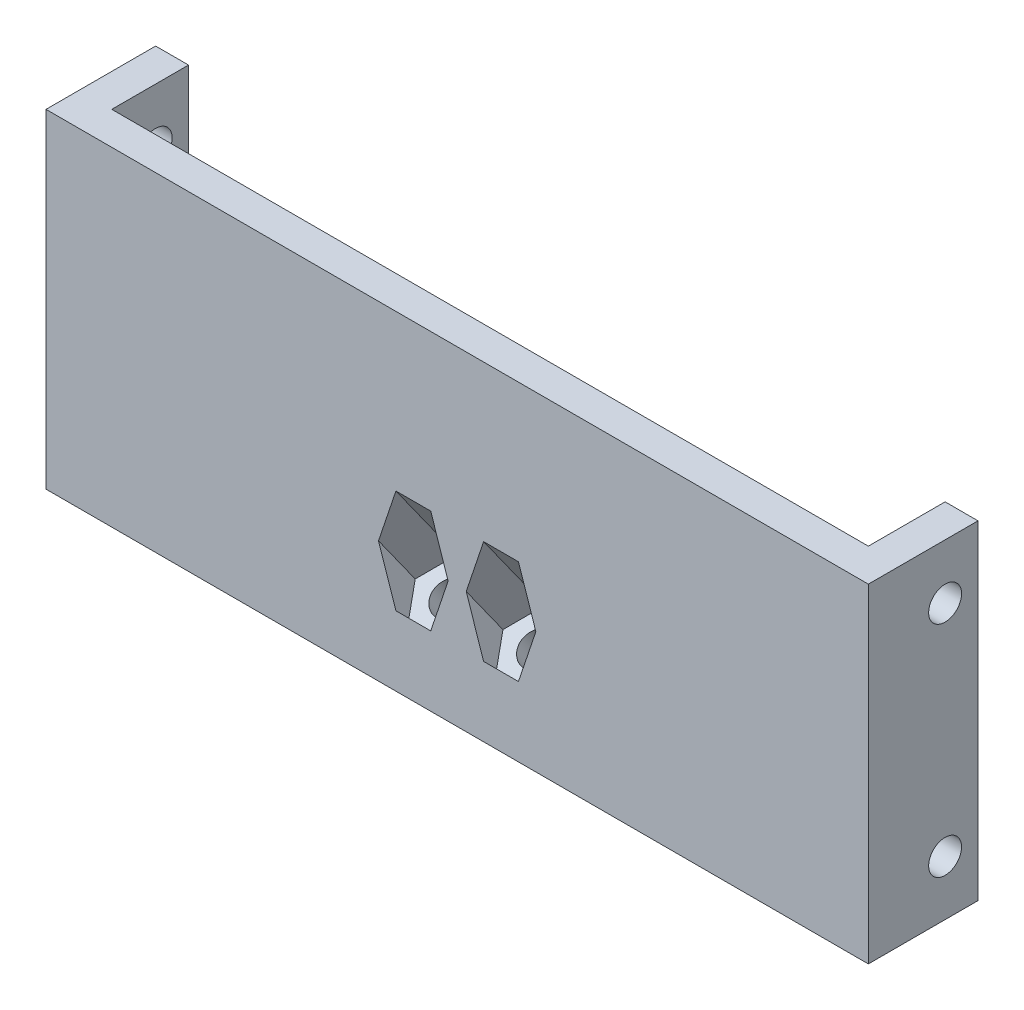
ISO-10303-21;
HEADER;
FILE_DESCRIPTION(('STEP AP214'),'2;1');
FILE_NAME('part.step','',(''),(''),'','','');
FILE_SCHEMA(('AUTOMOTIVE_DESIGN { 1 0 10303 214 1 1 1 1 }'));
ENDSEC;
DATA;
#1=APPLICATION_CONTEXT('core data for automotive mechanical design processes');
#2=APPLICATION_PROTOCOL_DEFINITION('international standard','automotive_design',2000,#1);
#3=PRODUCT_CONTEXT('',#1,'mechanical');
#4=PRODUCT('Part','Part','',(#3));
#5=PRODUCT_RELATED_PRODUCT_CATEGORY('part','',(#4));
#6=PRODUCT_DEFINITION_FORMATION('','',#4);
#7=PRODUCT_DEFINITION_CONTEXT('part definition',#1,'design');
#8=PRODUCT_DEFINITION('design','',#6,#7);
#9=PRODUCT_DEFINITION_SHAPE('','',#8);
#10=(LENGTH_UNIT() NAMED_UNIT(*) SI_UNIT(.MILLI.,.METRE.));
#11=(NAMED_UNIT(*) PLANE_ANGLE_UNIT() SI_UNIT($,.RADIAN.));
#12=(NAMED_UNIT(*) SI_UNIT($,.STERADIAN.) SOLID_ANGLE_UNIT());
#13=UNCERTAINTY_MEASURE_WITH_UNIT(LENGTH_MEASURE(1.E-05),#10,'distance_accuracy_value','');
#14=(GEOMETRIC_REPRESENTATION_CONTEXT(3) GLOBAL_UNCERTAINTY_ASSIGNED_CONTEXT((#13)) GLOBAL_UNIT_ASSIGNED_CONTEXT((#10,
#11,#12)) REPRESENTATION_CONTEXT('',''));
#15=CARTESIAN_POINT('',(0.,0.,0.));
#16=DIRECTION('',(0.,0.,1.));
#17=DIRECTION('',(1.,0.,0.));
#18=AXIS2_PLACEMENT_3D('',#15,#16,#17);
#19=CARTESIAN_POINT('',(37.5,-15.,3.));
#20=DIRECTION('',(-1.,0.,0.));
#21=DIRECTION('',(0.,0.,1.));
#22=AXIS2_PLACEMENT_3D('',#19,#20,#21);
#23=PLANE('',#22);
#24=CARTESIAN_POINT('',(37.5,-10.,-4.));
#25=DIRECTION('',(1.,0.,0.));
#26=DIRECTION('',(0.,0.,1.));
#27=AXIS2_PLACEMENT_3D('',#24,#25,#26);
#28=CIRCLE('',#27,1.5);
#29=CARTESIAN_POINT('',(37.5,-10.,-2.5));
#30=VERTEX_POINT('',#29);
#31=EDGE_CURVE('E323',#30,#30,#28,.T.);
#32=ORIENTED_EDGE('',*,*,#31,.F.);
#33=EDGE_LOOP('',(#32));
#34=FACE_BOUND('',#33,.T.);
#35=CARTESIAN_POINT('',(37.5,10.,-4.));
#36=DIRECTION('',(-1.,0.,0.));
#37=DIRECTION('',(0.,0.,1.));
#38=AXIS2_PLACEMENT_3D('',#35,#36,#37);
#39=CIRCLE('',#38,1.5);
#40=CARTESIAN_POINT('',(37.5,10.,-2.5));
#41=VERTEX_POINT('',#40);
#42=EDGE_CURVE('E329',#41,#41,#39,.T.);
#43=ORIENTED_EDGE('',*,*,#42,.T.);
#44=EDGE_LOOP('',(#43));
#45=FACE_BOUND('',#44,.T.);
#46=DIRECTION('',(0.,0.,-1.));
#47=VECTOR('',#46,1.);
#48=CARTESIAN_POINT('',(37.5,-15.,3.));
#49=LINE('',#48,#47);
#50=CARTESIAN_POINT('',(37.5,-15.,3.));
#51=VERTEX_POINT('',#50);
#52=CARTESIAN_POINT('',(37.5,-15.,-7.));
#53=VERTEX_POINT('',#52);
#54=EDGE_CURVE('E364',#51,#53,#49,.T.);
#55=ORIENTED_EDGE('',*,*,#54,.T.);
#56=DIRECTION('',(0.,-1.,0.));
#57=VECTOR('',#56,1.);
#58=CARTESIAN_POINT('',(37.5,-15.,-7.));
#59=LINE('',#58,#57);
#60=CARTESIAN_POINT('',(37.5,15.,-7.));
#61=VERTEX_POINT('',#60);
#62=EDGE_CURVE('E335',#61,#53,#59,.T.);
#63=ORIENTED_EDGE('',*,*,#62,.F.);
#64=DIRECTION('',(0.,0.,-1.));
#65=VECTOR('',#64,1.);
#66=CARTESIAN_POINT('',(37.5,15.,3.));
#67=LINE('',#66,#65);
#68=CARTESIAN_POINT('',(37.5,15.,3.));
#69=VERTEX_POINT('',#68);
#70=EDGE_CURVE('E375',#69,#61,#67,.T.);
#71=ORIENTED_EDGE('',*,*,#70,.F.);
#72=DIRECTION('',(0.,1.,0.));
#73=VECTOR('',#72,1.);
#74=CARTESIAN_POINT('',(37.5,-15.,3.));
#75=LINE('',#74,#73);
#76=EDGE_CURVE('E354',#51,#69,#75,.T.);
#77=ORIENTED_EDGE('',*,*,#76,.F.);
#78=EDGE_LOOP('',(#55,#63,#71,#77));
#79=FACE_BOUND('',#78,.T.);
#80=ADVANCED_FACE('F35',(#34,#45,#79),#23,.F.);
#81=CARTESIAN_POINT('',(-37.5,15.,3.));
#82=DIRECTION('',(0.,-1.,0.));
#83=DIRECTION('',(0.,0.,-1.));
#84=AXIS2_PLACEMENT_3D('',#81,#82,#83);
#85=PLANE('',#84);
#86=ORIENTED_EDGE('',*,*,#70,.T.);
#87=DIRECTION('',(1.,0.,0.));
#88=VECTOR('',#87,1.);
#89=CARTESIAN_POINT('',(34.5,15.,-7.));
#90=LINE('',#89,#88);
#91=CARTESIAN_POINT('',(34.5,15.,-7.));
#92=VERTEX_POINT('',#91);
#93=EDGE_CURVE('E342',#92,#61,#90,.T.);
#94=ORIENTED_EDGE('',*,*,#93,.F.);
#95=DIRECTION('',(0.,0.,1.));
#96=VECTOR('',#95,1.);
#97=CARTESIAN_POINT('',(34.5,15.,-7.));
#98=LINE('',#97,#96);
#99=CARTESIAN_POINT('',(34.5,15.,0.));
#100=VERTEX_POINT('',#99);
#101=EDGE_CURVE('E345',#92,#100,#98,.T.);
#102=ORIENTED_EDGE('',*,*,#101,.T.);
#103=DIRECTION('',(-1.,0.,0.));
#104=VECTOR('',#103,1.);
#105=CARTESIAN_POINT('',(-37.5,15.,0.));
#106=LINE('',#105,#104);
#107=CARTESIAN_POINT('',(-34.5,15.,0.));
#108=VERTEX_POINT('',#107);
#109=EDGE_CURVE('E353',#100,#108,#106,.T.);
#110=ORIENTED_EDGE('',*,*,#109,.T.);
#111=DIRECTION('',(0.,0.,1.));
#112=VECTOR('',#111,1.);
#113=CARTESIAN_POINT('',(-34.5,15.,-7.));
#114=LINE('',#113,#112);
#115=CARTESIAN_POINT('',(-34.5,15.,-7.));
#116=VERTEX_POINT('',#115);
#117=EDGE_CURVE('E320',#116,#108,#114,.T.);
#118=ORIENTED_EDGE('',*,*,#117,.F.);
#119=DIRECTION('',(-1.,0.,0.));
#120=VECTOR('',#119,1.);
#121=CARTESIAN_POINT('',(-34.5,15.,-7.));
#122=LINE('',#121,#120);
#123=CARTESIAN_POINT('',(-37.5,15.,-7.));
#124=VERTEX_POINT('',#123);
#125=EDGE_CURVE('E306',#116,#124,#122,.T.);
#126=ORIENTED_EDGE('',*,*,#125,.T.);
#127=DIRECTION('',(0.,0.,-1.));
#128=VECTOR('',#127,1.);
#129=CARTESIAN_POINT('',(-37.5,15.,3.));
#130=LINE('',#129,#128);
#131=CARTESIAN_POINT('',(-37.5,15.,3.));
#132=VERTEX_POINT('',#131);
#133=EDGE_CURVE('E373',#132,#124,#130,.T.);
#134=ORIENTED_EDGE('',*,*,#133,.F.);
#135=DIRECTION('',(-1.,0.,0.));
#136=VECTOR('',#135,1.);
#137=CARTESIAN_POINT('',(-37.5,15.,3.));
#138=LINE('',#137,#136);
#139=EDGE_CURVE('E357',#69,#132,#138,.T.);
#140=ORIENTED_EDGE('',*,*,#139,.F.);
#141=EDGE_LOOP('',(#86,#94,#102,#110,#118,#126,#134,#140));
#142=FACE_BOUND('',#141,.T.);
#143=ADVANCED_FACE('F462',(#142),#85,.F.);
#144=CARTESIAN_POINT('',(-37.5,-15.,3.));
#145=DIRECTION('',(1.,0.,0.));
#146=DIRECTION('',(0.,0.,-1.));
#147=AXIS2_PLACEMENT_3D('',#144,#145,#146);
#148=PLANE('',#147);
#149=CARTESIAN_POINT('',(-37.5,-10.,-4.));
#150=DIRECTION('',(1.,0.,0.));
#151=DIRECTION('',(0.,0.,1.));
#152=AXIS2_PLACEMENT_3D('',#149,#150,#151);
#153=CIRCLE('',#152,1.5);
#154=CARTESIAN_POINT('',(-37.5,-10.,-2.5));
#155=VERTEX_POINT('',#154);
#156=EDGE_CURVE('E291',#155,#155,#153,.T.);
#157=ORIENTED_EDGE('',*,*,#156,.T.);
#158=EDGE_LOOP('',(#157));
#159=FACE_BOUND('',#158,.T.);
#160=CARTESIAN_POINT('',(-37.5,10.,-4.));
#161=DIRECTION('',(-1.,0.,0.));
#162=DIRECTION('',(0.,0.,1.));
#163=AXIS2_PLACEMENT_3D('',#160,#161,#162);
#164=CIRCLE('',#163,1.5);
#165=CARTESIAN_POINT('',(-37.5,10.,-2.5));
#166=VERTEX_POINT('',#165);
#167=EDGE_CURVE('E297',#166,#166,#164,.T.);
#168=ORIENTED_EDGE('',*,*,#167,.F.);
#169=EDGE_LOOP('',(#168));
#170=FACE_BOUND('',#169,.T.);
#171=ORIENTED_EDGE('',*,*,#133,.T.);
#172=DIRECTION('',(0.,-1.,0.));
#173=VECTOR('',#172,1.);
#174=CARTESIAN_POINT('',(-37.5,-15.,-7.));
#175=LINE('',#174,#173);
#176=CARTESIAN_POINT('',(-37.5,-15.,-7.));
#177=VERTEX_POINT('',#176);
#178=EDGE_CURVE('E303',#124,#177,#175,.T.);
#179=ORIENTED_EDGE('',*,*,#178,.T.);
#180=DIRECTION('',(0.,0.,-1.));
#181=VECTOR('',#180,1.);
#182=CARTESIAN_POINT('',(-37.5,-15.,3.));
#183=LINE('',#182,#181);
#184=CARTESIAN_POINT('',(-37.5,-15.,3.));
#185=VERTEX_POINT('',#184);
#186=EDGE_CURVE('E371',#185,#177,#183,.T.);
#187=ORIENTED_EDGE('',*,*,#186,.F.);
#188=DIRECTION('',(0.,-1.,0.));
#189=VECTOR('',#188,1.);
#190=CARTESIAN_POINT('',(-37.5,-15.,3.));
#191=LINE('',#190,#189);
#192=EDGE_CURVE('E360',#132,#185,#191,.T.);
#193=ORIENTED_EDGE('',*,*,#192,.F.);
#194=EDGE_LOOP('',(#171,#179,#187,#193));
#195=FACE_BOUND('',#194,.T.);
#196=ADVANCED_FACE('F468',(#159,#170,#195),#148,.F.);
#197=CARTESIAN_POINT('',(-37.5,-15.,3.));
#198=DIRECTION('',(0.,1.,0.));
#199=DIRECTION('',(0.,0.,1.));
#200=AXIS2_PLACEMENT_3D('',#197,#198,#199);
#201=PLANE('',#200);
#202=DIRECTION('',(1.,0.,0.));
#203=VECTOR('',#202,1.);
#204=CARTESIAN_POINT('',(-37.5,-15.,0.));
#205=LINE('',#204,#203);
#206=CARTESIAN_POINT('',(-34.5,-15.,0.));
#207=VERTEX_POINT('',#206);
#208=CARTESIAN_POINT('',(-8.,-15.,0.));
#209=VERTEX_POINT('',#208);
#210=EDGE_CURVE('E358',#207,#209,#205,.T.);
#211=ORIENTED_EDGE('',*,*,#210,.T.);
#212=DIRECTION('',(1.,0.,0.));
#213=VECTOR('',#212,1.);
#214=CARTESIAN_POINT('',(8.,-15.,0.));
#215=LINE('',#214,#213);
#216=CARTESIAN_POINT('',(8.,-15.,0.));
#217=VERTEX_POINT('',#216);
#218=EDGE_CURVE('E377',#209,#217,#215,.T.);
#219=ORIENTED_EDGE('',*,*,#218,.T.);
#220=CARTESIAN_POINT('',(34.5,-15.,0.));
#221=VERTEX_POINT('',#220);
#222=EDGE_CURVE('E367',#217,#221,#205,.T.);
#223=ORIENTED_EDGE('',*,*,#222,.T.);
#224=DIRECTION('',(0.,0.,1.));
#225=VECTOR('',#224,1.);
#226=CARTESIAN_POINT('',(34.5,-15.,-7.));
#227=LINE('',#226,#225);
#228=CARTESIAN_POINT('',(34.5,-15.,-7.));
#229=VERTEX_POINT('',#228);
#230=EDGE_CURVE('E350',#229,#221,#227,.T.);
#231=ORIENTED_EDGE('',*,*,#230,.F.);
#232=DIRECTION('',(-1.,0.,0.));
#233=VECTOR('',#232,1.);
#234=CARTESIAN_POINT('',(34.5,-15.,-7.));
#235=LINE('',#234,#233);
#236=EDGE_CURVE('E338',#53,#229,#235,.T.);
#237=ORIENTED_EDGE('',*,*,#236,.F.);
#238=ORIENTED_EDGE('',*,*,#54,.F.);
#239=DIRECTION('',(1.,0.,0.));
#240=VECTOR('',#239,1.);
#241=CARTESIAN_POINT('',(-37.5,-15.,3.));
#242=LINE('',#241,#240);
#243=EDGE_CURVE('E362',#185,#51,#242,.T.);
#244=ORIENTED_EDGE('',*,*,#243,.F.);
#245=ORIENTED_EDGE('',*,*,#186,.T.);
#246=DIRECTION('',(1.,0.,0.));
#247=VECTOR('',#246,1.);
#248=CARTESIAN_POINT('',(-34.5,-15.,-7.));
#249=LINE('',#248,#247);
#250=CARTESIAN_POINT('',(-34.5,-15.,-7.));
#251=VERTEX_POINT('',#250);
#252=EDGE_CURVE('E312',#177,#251,#249,.T.);
#253=ORIENTED_EDGE('',*,*,#252,.T.);
#254=DIRECTION('',(0.,0.,1.));
#255=VECTOR('',#254,1.);
#256=CARTESIAN_POINT('',(-34.5,-15.,-7.));
#257=LINE('',#256,#255);
#258=EDGE_CURVE('E315',#251,#207,#257,.T.);
#259=ORIENTED_EDGE('',*,*,#258,.T.);
#260=EDGE_LOOP('',(#211,#219,#223,#231,#237,#238,#244,#245,#253,#259));
#261=FACE_BOUND('',#260,.T.);
#262=ADVANCED_FACE('F513',(#261),#201,.F.);
#263=CARTESIAN_POINT('',(0.,0.,3.));
#264=DIRECTION('',(0.,0.,-1.));
#265=DIRECTION('',(-1.,0.,0.));
#266=AXIS2_PLACEMENT_3D('',#263,#264,#265);
#267=PLANE('',#266);
#268=DIRECTION('',(1.,0.,0.));
#269=VECTOR('',#268,1.);
#270=CARTESIAN_POINT('',(0.,0.813139110507579,3.));
#271=LINE('',#270,#269);
#272=CARTESIAN_POINT('',(-5.58771324027147,0.813139110507578,3.));
#273=VERTEX_POINT('',#272);
#274=CARTESIAN_POINT('',(-2.41228675972853,0.813139110507578,3.));
#275=VERTEX_POINT('',#274);
#276=EDGE_CURVE('E44',#273,#275,#271,.T.);
#277=ORIENTED_EDGE('',*,*,#276,.T.);
#278=DIRECTION('',(0.318142381487888,-0.948042944755782,0.));
#279=VECTOR('',#278,1.);
#280=CARTESIAN_POINT('',(-1.92287514684069,-0.645274649111341,3.));
#281=LINE('',#280,#279);
#282=CARTESIAN_POINT('',(-0.824573519457062,-3.91813978636587,3.));
#283=VERTEX_POINT('',#282);
#284=EDGE_CURVE('E11',#275,#283,#281,.T.);
#285=ORIENTED_EDGE('',*,*,#284,.T.);
#286=DIRECTION('',(-0.318142381487888,-0.948042944755782,0.));
#287=VECTOR('',#286,1.);
#288=CARTESIAN_POINT('',(0.440645824415849,-0.147871056630736,3.));
#289=LINE('',#288,#287);
#290=CARTESIAN_POINT('',(-2.41228675972853,-8.64941868323933,3.));
#291=VERTEX_POINT('',#290);
#292=EDGE_CURVE('E206',#283,#291,#289,.T.);
#293=ORIENTED_EDGE('',*,*,#292,.T.);
#294=DIRECTION('',(-1.,0.,0.));
#295=VECTOR('',#294,1.);
#296=CARTESIAN_POINT('',(0.,-8.64941868323933,3.));
#297=LINE('',#296,#295);
#298=CARTESIAN_POINT('',(-5.58771324027147,-8.64941868323934,3.));
#299=VERTEX_POINT('',#298);
#300=EDGE_CURVE('E429',#291,#299,#297,.T.);
#301=ORIENTED_EDGE('',*,*,#300,.T.);
#302=DIRECTION('',(-0.318142381487888,0.948042944755782,0.));
#303=VECTOR('',#302,1.);
#304=CARTESIAN_POINT('',(-7.63092922522558,-2.5607721782099,3.));
#305=LINE('',#304,#303);
#306=CARTESIAN_POINT('',(-7.17542648054294,-3.91813978636588,3.));
#307=VERTEX_POINT('',#306);
#308=EDGE_CURVE('E432',#299,#307,#305,.T.);
#309=ORIENTED_EDGE('',*,*,#308,.T.);
#310=DIRECTION('',(0.318142381487888,0.948042944755782,0.));
#311=VECTOR('',#310,1.);
#312=CARTESIAN_POINT('',(-5.26740825396904,1.76762647246782,3.));
#313=LINE('',#312,#311);
#314=EDGE_CURVE('E435',#307,#273,#313,.T.);
#315=ORIENTED_EDGE('',*,*,#314,.T.);
#316=EDGE_LOOP('',(#277,#285,#293,#301,#309,#315));
#317=FACE_BOUND('',#316,.T.);
#318=DIRECTION('',(1.,0.,0.));
#319=VECTOR('',#318,1.);
#320=CARTESIAN_POINT('',(0.,0.813139110507579,3.));
#321=LINE('',#320,#319);
#322=CARTESIAN_POINT('',(2.41228675972853,0.813139110507585,3.));
#323=VERTEX_POINT('',#322);
#324=CARTESIAN_POINT('',(5.58771324027147,0.813139110507578,3.));
#325=VERTEX_POINT('',#324);
#326=EDGE_CURVE('E422',#323,#325,#321,.T.);
#327=ORIENTED_EDGE('',*,*,#326,.T.);
#328=DIRECTION('',(0.318142381487888,-0.948042944755782,0.));
#329=VECTOR('',#328,1.);
#330=CARTESIAN_POINT('',(5.26740825396904,1.76762647246782,3.));
#331=LINE('',#330,#329);
#332=CARTESIAN_POINT('',(7.17542648054294,-3.91813978636588,3.));
#333=VERTEX_POINT('',#332);
#334=EDGE_CURVE('E425',#325,#333,#331,.T.);
#335=ORIENTED_EDGE('',*,*,#334,.T.);
#336=DIRECTION('',(-0.318142381487889,-0.948042944755782,0.));
#337=VECTOR('',#336,1.);
#338=CARTESIAN_POINT('',(7.63092922522557,-2.5607721782099,3.));
#339=LINE('',#338,#337);
#340=CARTESIAN_POINT('',(5.58771324027147,-8.64941868323934,3.));
#341=VERTEX_POINT('',#340);
#342=EDGE_CURVE('E406',#333,#341,#339,.T.);
#343=ORIENTED_EDGE('',*,*,#342,.T.);
#344=DIRECTION('',(-1.,0.,0.));
#345=VECTOR('',#344,1.);
#346=CARTESIAN_POINT('',(0.,-8.64941868323933,3.));
#347=LINE('',#346,#345);
#348=CARTESIAN_POINT('',(2.41228675972853,-8.64941868323934,3.));
#349=VERTEX_POINT('',#348);
#350=EDGE_CURVE('E413',#341,#349,#347,.T.);
#351=ORIENTED_EDGE('',*,*,#350,.T.);
#352=DIRECTION('',(-0.318142381487888,0.948042944755782,0.));
#353=VECTOR('',#352,1.);
#354=CARTESIAN_POINT('',(-0.440645824415854,-0.147871056630738,3.));
#355=LINE('',#354,#353);
#356=CARTESIAN_POINT('',(0.824573519457056,-3.91813978636587,3.));
#357=VERTEX_POINT('',#356);
#358=EDGE_CURVE('E416',#349,#357,#355,.T.);
#359=ORIENTED_EDGE('',*,*,#358,.T.);
#360=DIRECTION('',(0.318142381487888,0.948042944755782,0.));
#361=VECTOR('',#360,1.);
#362=CARTESIAN_POINT('',(1.92287514684068,-0.645274649111339,3.));
#363=LINE('',#362,#361);
#364=EDGE_CURVE('E419',#357,#323,#363,.T.);
#365=ORIENTED_EDGE('',*,*,#364,.T.);
#366=EDGE_LOOP('',(#327,#335,#343,#351,#359,#365));
#367=FACE_BOUND('',#366,.T.);
#368=ORIENTED_EDGE('',*,*,#76,.T.);
#369=ORIENTED_EDGE('',*,*,#139,.T.);
#370=ORIENTED_EDGE('',*,*,#192,.T.);
#371=ORIENTED_EDGE('',*,*,#243,.T.);
#372=EDGE_LOOP('',(#368,#369,#370,#371));
#373=FACE_BOUND('',#372,.T.);
#374=ADVANCED_FACE('F439',(#317,#367,#373),#267,.F.);
#375=CARTESIAN_POINT('',(0.,0.,0.));
#376=DIRECTION('',(0.,0.,-1.));
#377=DIRECTION('',(-1.,0.,0.));
#378=AXIS2_PLACEMENT_3D('',#375,#376,#377);
#379=PLANE('',#378);
#380=DIRECTION('',(-1.,0.,0.));
#381=VECTOR('',#380,1.);
#382=CARTESIAN_POINT('',(0.,-1.99999999999996,0.));
#383=LINE('',#382,#381);
#384=CARTESIAN_POINT('',(8.,-1.99999999999996,0.));
#385=VERTEX_POINT('',#384);
#386=CARTESIAN_POINT('',(-8.,-1.99999999999996,0.));
#387=VERTEX_POINT('',#386);
#388=EDGE_CURVE('E388',#385,#387,#383,.T.);
#389=ORIENTED_EDGE('',*,*,#388,.T.);
#390=DIRECTION('',(0.,-1.,0.));
#391=VECTOR('',#390,1.);
#392=CARTESIAN_POINT('',(-8.,-7.,0.));
#393=LINE('',#392,#391);
#394=EDGE_CURVE('E281',#387,#209,#393,.T.);
#395=ORIENTED_EDGE('',*,*,#394,.T.);
#396=ORIENTED_EDGE('',*,*,#210,.F.);
#397=DIRECTION('',(0.,1.,0.));
#398=VECTOR('',#397,1.);
#399=CARTESIAN_POINT('',(-34.5,-15.,0.));
#400=LINE('',#399,#398);
#401=EDGE_CURVE('E300',#207,#108,#400,.T.);
#402=ORIENTED_EDGE('',*,*,#401,.T.);
#403=ORIENTED_EDGE('',*,*,#109,.F.);
#404=DIRECTION('',(0.,1.,0.));
#405=VECTOR('',#404,1.);
#406=CARTESIAN_POINT('',(34.5,-15.,0.));
#407=LINE('',#406,#405);
#408=EDGE_CURVE('E332',#221,#100,#407,.T.);
#409=ORIENTED_EDGE('',*,*,#408,.F.);
#410=ORIENTED_EDGE('',*,*,#222,.F.);
#411=DIRECTION('',(0.,-1.,0.));
#412=VECTOR('',#411,1.);
#413=CARTESIAN_POINT('',(8.,-7.,0.));
#414=LINE('',#413,#412);
#415=EDGE_CURVE('E285',#385,#217,#414,.T.);
#416=ORIENTED_EDGE('',*,*,#415,.F.);
#417=EDGE_LOOP('',(#389,#395,#396,#402,#403,#409,#410,#416));
#418=FACE_BOUND('',#417,.T.);
#419=ADVANCED_FACE('F511',(#418),#379,.T.);
#420=CARTESIAN_POINT('',(34.5,-15.,-7.));
#421=DIRECTION('',(1.,0.,0.));
#422=DIRECTION('',(0.,0.,-1.));
#423=AXIS2_PLACEMENT_3D('',#420,#421,#422);
#424=PLANE('',#423);
#425=CARTESIAN_POINT('',(34.5,-10.,-4.));
#426=DIRECTION('',(1.,0.,0.));
#427=DIRECTION('',(0.,0.,1.));
#428=AXIS2_PLACEMENT_3D('',#425,#426,#427);
#429=CIRCLE('',#428,1.5);
#430=CARTESIAN_POINT('',(34.5,-10.,-2.5));
#431=VERTEX_POINT('',#430);
#432=EDGE_CURVE('E322',#431,#431,#429,.T.);
#433=ORIENTED_EDGE('',*,*,#432,.T.);
#434=EDGE_LOOP('',(#433));
#435=FACE_BOUND('',#434,.T.);
#436=CARTESIAN_POINT('',(34.5,10.,-4.));
#437=DIRECTION('',(-1.,0.,0.));
#438=DIRECTION('',(0.,0.,1.));
#439=AXIS2_PLACEMENT_3D('',#436,#437,#438);
#440=CIRCLE('',#439,1.5);
#441=CARTESIAN_POINT('',(34.5,10.,-2.5));
#442=VERTEX_POINT('',#441);
#443=EDGE_CURVE('E326',#442,#442,#440,.T.);
#444=ORIENTED_EDGE('',*,*,#443,.F.);
#445=EDGE_LOOP('',(#444));
#446=FACE_BOUND('',#445,.T.);
#447=ORIENTED_EDGE('',*,*,#408,.T.);
#448=ORIENTED_EDGE('',*,*,#101,.F.);
#449=DIRECTION('',(0.,1.,0.));
#450=VECTOR('',#449,1.);
#451=CARTESIAN_POINT('',(34.5,-15.,-7.));
#452=LINE('',#451,#450);
#453=EDGE_CURVE('E340',#229,#92,#452,.T.);
#454=ORIENTED_EDGE('',*,*,#453,.F.);
#455=ORIENTED_EDGE('',*,*,#230,.T.);
#456=EDGE_LOOP('',(#447,#448,#454,#455));
#457=FACE_BOUND('',#456,.T.);
#458=ADVANCED_FACE('F528',(#435,#446,#457),#424,.F.);
#459=CARTESIAN_POINT('',(0.,0.,-7.));
#460=DIRECTION('',(0.,0.,-1.));
#461=DIRECTION('',(-1.,0.,0.));
#462=AXIS2_PLACEMENT_3D('',#459,#460,#461);
#463=PLANE('',#462);
#464=ORIENTED_EDGE('',*,*,#62,.T.);
#465=ORIENTED_EDGE('',*,*,#236,.T.);
#466=ORIENTED_EDGE('',*,*,#453,.T.);
#467=ORIENTED_EDGE('',*,*,#93,.T.);
#468=EDGE_LOOP('',(#464,#465,#466,#467));
#469=FACE_BOUND('',#468,.T.);
#470=ADVANCED_FACE('F535',(#469),#463,.T.);
#471=CARTESIAN_POINT('',(37.5,10.,-4.));
#472=DIRECTION('',(-1.,0.,0.));
#473=DIRECTION('',(0.,0.,1.));
#474=AXIS2_PLACEMENT_3D('',#471,#472,#473);
#475=CYLINDRICAL_SURFACE('',#474,1.5);
#476=ORIENTED_EDGE('',*,*,#42,.F.);
#477=EDGE_LOOP('',(#476));
#478=FACE_BOUND('',#477,.T.);
#479=ORIENTED_EDGE('',*,*,#443,.T.);
#480=EDGE_LOOP('',(#479));
#481=FACE_BOUND('',#480,.T.);
#482=ADVANCED_FACE('F569',(#478,#481),#475,.F.);
#483=CARTESIAN_POINT('',(37.5,-10.,-4.));
#484=DIRECTION('',(-1.,0.,0.));
#485=DIRECTION('',(0.,0.,1.));
#486=AXIS2_PLACEMENT_3D('',#483,#484,#485);
#487=CYLINDRICAL_SURFACE('',#486,1.5);
#488=ORIENTED_EDGE('',*,*,#31,.T.);
#489=EDGE_LOOP('',(#488));
#490=FACE_BOUND('',#489,.T.);
#491=ORIENTED_EDGE('',*,*,#432,.F.);
#492=EDGE_LOOP('',(#491));
#493=FACE_BOUND('',#492,.T.);
#494=ADVANCED_FACE('F565',(#490,#493),#487,.F.);
#495=CARTESIAN_POINT('',(-34.5,-15.,-7.));
#496=DIRECTION('',(1.,0.,0.));
#497=DIRECTION('',(0.,0.,-1.));
#498=AXIS2_PLACEMENT_3D('',#495,#496,#497);
#499=PLANE('',#498);
#500=CARTESIAN_POINT('',(-34.5,-10.,-4.));
#501=DIRECTION('',(1.,0.,0.));
#502=DIRECTION('',(0.,0.,1.));
#503=AXIS2_PLACEMENT_3D('',#500,#501,#502);
#504=CIRCLE('',#503,1.5);
#505=CARTESIAN_POINT('',(-34.5,-10.,-2.5));
#506=VERTEX_POINT('',#505);
#507=EDGE_CURVE('E284',#506,#506,#504,.T.);
#508=ORIENTED_EDGE('',*,*,#507,.F.);
#509=EDGE_LOOP('',(#508));
#510=FACE_BOUND('',#509,.T.);
#511=CARTESIAN_POINT('',(-34.5,10.,-4.));
#512=DIRECTION('',(-1.,0.,0.));
#513=DIRECTION('',(0.,0.,1.));
#514=AXIS2_PLACEMENT_3D('',#511,#512,#513);
#515=CIRCLE('',#514,1.5);
#516=CARTESIAN_POINT('',(-34.5,10.,-2.5));
#517=VERTEX_POINT('',#516);
#518=EDGE_CURVE('E294',#517,#517,#515,.T.);
#519=ORIENTED_EDGE('',*,*,#518,.T.);
#520=EDGE_LOOP('',(#519));
#521=FACE_BOUND('',#520,.T.);
#522=ORIENTED_EDGE('',*,*,#401,.F.);
#523=ORIENTED_EDGE('',*,*,#258,.F.);
#524=DIRECTION('',(0.,1.,0.));
#525=VECTOR('',#524,1.);
#526=CARTESIAN_POINT('',(-34.5,-15.,-7.));
#527=LINE('',#526,#525);
#528=EDGE_CURVE('E309',#251,#116,#527,.T.);
#529=ORIENTED_EDGE('',*,*,#528,.T.);
#530=ORIENTED_EDGE('',*,*,#117,.T.);
#531=EDGE_LOOP('',(#522,#523,#529,#530));
#532=FACE_BOUND('',#531,.T.);
#533=ADVANCED_FACE('F517',(#510,#521,#532),#499,.T.);
#534=CARTESIAN_POINT('',(0.,0.,-7.));
#535=DIRECTION('',(0.,0.,-1.));
#536=DIRECTION('',(1.,0.,0.));
#537=AXIS2_PLACEMENT_3D('',#534,#535,#536);
#538=PLANE('',#537);
#539=ORIENTED_EDGE('',*,*,#178,.F.);
#540=ORIENTED_EDGE('',*,*,#125,.F.);
#541=ORIENTED_EDGE('',*,*,#528,.F.);
#542=ORIENTED_EDGE('',*,*,#252,.F.);
#543=EDGE_LOOP('',(#539,#540,#541,#542));
#544=FACE_BOUND('',#543,.T.);
#545=ADVANCED_FACE('F521',(#544),#538,.T.);
#546=CARTESIAN_POINT('',(-37.5,10.,-4.));
#547=DIRECTION('',(1.,0.,0.));
#548=DIRECTION('',(0.,0.,-1.));
#549=AXIS2_PLACEMENT_3D('',#546,#547,#548);
#550=CYLINDRICAL_SURFACE('',#549,1.5);
#551=ORIENTED_EDGE('',*,*,#167,.T.);
#552=EDGE_LOOP('',(#551));
#553=FACE_BOUND('',#552,.T.);
#554=ORIENTED_EDGE('',*,*,#518,.F.);
#555=EDGE_LOOP('',(#554));
#556=FACE_BOUND('',#555,.T.);
#557=ADVANCED_FACE('F556',(#553,#556),#550,.F.);
#558=CARTESIAN_POINT('',(-37.5,-10.,-4.));
#559=DIRECTION('',(1.,0.,0.));
#560=DIRECTION('',(0.,0.,-1.));
#561=AXIS2_PLACEMENT_3D('',#558,#559,#560);
#562=CYLINDRICAL_SURFACE('',#561,1.5);
#563=ORIENTED_EDGE('',*,*,#156,.F.);
#564=EDGE_LOOP('',(#563));
#565=FACE_BOUND('',#564,.T.);
#566=ORIENTED_EDGE('',*,*,#507,.T.);
#567=EDGE_LOOP('',(#566));
#568=FACE_BOUND('',#567,.T.);
#569=ADVANCED_FACE('F549',(#565,#568),#562,.F.);
#570=CARTESIAN_POINT('',(-8.,-7.,0.));
#571=DIRECTION('',(-1.,0.,0.));
#572=DIRECTION('',(0.,0.,1.));
#573=AXIS2_PLACEMENT_3D('',#570,#571,#572);
#574=PLANE('',#573);
#575=DIRECTION('',(0.,-0.707106781186551,-0.707106781186544));
#576=VECTOR('',#575,1.);
#577=CARTESIAN_POINT('',(-8.,-1.99999999999996,0.));
#578=LINE('',#577,#576);
#579=CARTESIAN_POINT('',(-8.,-7.,-4.99999999999998));
#580=VERTEX_POINT('',#579);
#581=EDGE_CURVE('E394',#387,#580,#578,.T.);
#582=ORIENTED_EDGE('',*,*,#581,.T.);
#583=DIRECTION('',(0.,-0.707106781186548,-0.707106781186548));
#584=VECTOR('',#583,1.);
#585=CARTESIAN_POINT('',(-8.,-4.50000000000001,-2.49999999999999));
#586=LINE('',#585,#584);
#587=CARTESIAN_POINT('',(-8.,-9.00000000000001,-7.));
#588=VERTEX_POINT('',#587);
#589=EDGE_CURVE('E404',#580,#588,#586,.T.);
#590=ORIENTED_EDGE('',*,*,#589,.T.);
#591=DIRECTION('',(0.,-1.,0.));
#592=VECTOR('',#591,1.);
#593=CARTESIAN_POINT('',(-8.,-7.,-7.));
#594=LINE('',#593,#592);
#595=CARTESIAN_POINT('',(-8.,-9.99999999999999,-7.));
#596=VERTEX_POINT('',#595);
#597=EDGE_CURVE('E276',#588,#596,#594,.T.);
#598=ORIENTED_EDGE('',*,*,#597,.T.);
#599=DIRECTION('',(0.,-0.581238193719095,0.813733471206736));
#600=VECTOR('',#599,1.);
#601=CARTESIAN_POINT('',(-8.,-12.2972972972973,-3.78378378378377));
#602=LINE('',#601,#600);
#603=EDGE_CURVE('E386',#596,#209,#602,.T.);
#604=ORIENTED_EDGE('',*,*,#603,.T.);
#605=ORIENTED_EDGE('',*,*,#394,.F.);
#606=EDGE_LOOP('',(#582,#590,#598,#604,#605));
#607=FACE_BOUND('',#606,.T.);
#608=ADVANCED_FACE('F502',(#607),#574,.T.);
#609=CARTESIAN_POINT('',(8.,-7.,0.));
#610=DIRECTION('',(1.,0.,0.));
#611=DIRECTION('',(0.,0.,-1.));
#612=AXIS2_PLACEMENT_3D('',#609,#610,#611);
#613=PLANE('',#612);
#614=DIRECTION('',(0.,-1.,0.));
#615=VECTOR('',#614,1.);
#616=CARTESIAN_POINT('',(8.,-7.,-7.));
#617=LINE('',#616,#615);
#618=CARTESIAN_POINT('',(8.,-9.00000000000001,-7.));
#619=VERTEX_POINT('',#618);
#620=CARTESIAN_POINT('',(8.,-9.99999999999999,-7.));
#621=VERTEX_POINT('',#620);
#622=EDGE_CURVE('E288',#619,#621,#617,.T.);
#623=ORIENTED_EDGE('',*,*,#622,.F.);
#624=DIRECTION('',(0.,0.707106781186548,0.707106781186548));
#625=VECTOR('',#624,1.);
#626=CARTESIAN_POINT('',(8.,-4.50000000000001,-2.49999999999999));
#627=LINE('',#626,#625);
#628=CARTESIAN_POINT('',(8.,-7.,-4.99999999999998));
#629=VERTEX_POINT('',#628);
#630=EDGE_CURVE('E402',#619,#629,#627,.T.);
#631=ORIENTED_EDGE('',*,*,#630,.T.);
#632=DIRECTION('',(0.,0.707106781186551,0.707106781186544));
#633=VECTOR('',#632,1.);
#634=CARTESIAN_POINT('',(8.,-1.99999999999996,0.));
#635=LINE('',#634,#633);
#636=EDGE_CURVE('E396',#629,#385,#635,.T.);
#637=ORIENTED_EDGE('',*,*,#636,.T.);
#638=ORIENTED_EDGE('',*,*,#415,.T.);
#639=DIRECTION('',(0.,0.581238193719095,-0.813733471206736));
#640=VECTOR('',#639,1.);
#641=CARTESIAN_POINT('',(8.,-12.2972972972973,-3.78378378378377));
#642=LINE('',#641,#640);
#643=EDGE_CURVE('E380',#217,#621,#642,.T.);
#644=ORIENTED_EDGE('',*,*,#643,.T.);
#645=EDGE_LOOP('',(#623,#631,#637,#638,#644));
#646=FACE_BOUND('',#645,.T.);
#647=ADVANCED_FACE('F541',(#646),#613,.T.);
#648=CARTESIAN_POINT('',(-8.,-7.,-7.));
#649=DIRECTION('',(0.,0.,-1.));
#650=DIRECTION('',(-1.,0.,0.));
#651=AXIS2_PLACEMENT_3D('',#648,#649,#650);
#652=PLANE('',#651);
#653=ORIENTED_EDGE('',*,*,#597,.F.);
#654=DIRECTION('',(1.,0.,0.));
#655=VECTOR('',#654,1.);
#656=CARTESIAN_POINT('',(8.,-9.00000000000001,-7.));
#657=LINE('',#656,#655);
#658=EDGE_CURVE('E399',#588,#619,#657,.T.);
#659=ORIENTED_EDGE('',*,*,#658,.T.);
#660=ORIENTED_EDGE('',*,*,#622,.T.);
#661=DIRECTION('',(-1.,0.,0.));
#662=VECTOR('',#661,1.);
#663=CARTESIAN_POINT('',(-8.,-9.99999999999999,-7.));
#664=LINE('',#663,#662);
#665=EDGE_CURVE('E383',#621,#596,#664,.T.);
#666=ORIENTED_EDGE('',*,*,#665,.T.);
#667=EDGE_LOOP('',(#653,#659,#660,#666));
#668=FACE_BOUND('',#667,.T.);
#669=ADVANCED_FACE('F482',(#668),#652,.T.);
#670=CARTESIAN_POINT('',(-37.5,-15.,0.));
#671=DIRECTION('',(0.,-0.813733471206736,-0.581238193719096));
#672=DIRECTION('',(-1.,0.,0.));
#673=AXIS2_PLACEMENT_3D('',#670,#671,#672);
#674=PLANE('',#673);
#675=CARTESIAN_POINT('',(-4.,-12.6750472251236,-3.25493388482693));
#676=DIRECTION('',(0.,-0.813733471206736,-0.581238193719095));
#677=DIRECTION('',(0.,0.581238193719095,-0.813733471206736));
#678=AXIS2_PLACEMENT_3D('',#675,#676,#677);
#679=CIRCLE('',#678,1.5);
#680=CARTESIAN_POINT('',(-4.,-11.803189934545,-4.47553409163703));
#681=VERTEX_POINT('',#680);
#682=EDGE_CURVE('E273',#681,#681,#679,.T.);
#683=ORIENTED_EDGE('',*,*,#682,.F.);
#684=EDGE_LOOP('',(#683));
#685=FACE_BOUND('',#684,.T.);
#686=CARTESIAN_POINT('',(4.,-12.6750472251236,-3.25493388482693));
#687=DIRECTION('',(0.,-0.813733471206736,-0.581238193719095));
#688=DIRECTION('',(0.,0.581238193719095,-0.813733471206736));
#689=AXIS2_PLACEMENT_3D('',#686,#687,#688);
#690=CIRCLE('',#689,1.5);
#691=CARTESIAN_POINT('',(4.,-11.803189934545,-4.47553409163703));
#692=VERTEX_POINT('',#691);
#693=EDGE_CURVE('E277',#692,#692,#690,.T.);
#694=ORIENTED_EDGE('',*,*,#693,.F.);
#695=EDGE_LOOP('',(#694));
#696=FACE_BOUND('',#695,.T.);
#697=ORIENTED_EDGE('',*,*,#603,.F.);
#698=ORIENTED_EDGE('',*,*,#665,.F.);
#699=ORIENTED_EDGE('',*,*,#643,.F.);
#700=ORIENTED_EDGE('',*,*,#218,.F.);
#701=EDGE_LOOP('',(#697,#698,#699,#700));
#702=FACE_BOUND('',#701,.T.);
#703=ADVANCED_FACE('F476',(#685,#696,#702),#674,.T.);
#704=CARTESIAN_POINT('',(0.,-1.99999999999996,0.));
#705=DIRECTION('',(0.,-0.707106781186544,0.707106781186552));
#706=DIRECTION('',(-1.,0.,0.));
#707=AXIS2_PLACEMENT_3D('',#704,#705,#706);
#708=PLANE('',#707);
#709=ORIENTED_EDGE('',*,*,#636,.F.);
#710=DIRECTION('',(1.,0.,0.));
#711=VECTOR('',#710,1.);
#712=CARTESIAN_POINT('',(0.,-7.,-4.99999999999998));
#713=LINE('',#712,#711);
#714=EDGE_CURVE('E391',#580,#629,#713,.T.);
#715=ORIENTED_EDGE('',*,*,#714,.F.);
#716=ORIENTED_EDGE('',*,*,#581,.F.);
#717=ORIENTED_EDGE('',*,*,#388,.F.);
#718=EDGE_LOOP('',(#709,#715,#716,#717));
#719=FACE_BOUND('',#718,.T.);
#720=ADVANCED_FACE('F481',(#719),#708,.F.);
#721=CARTESIAN_POINT('',(-8.,-9.00000000000001,-7.));
#722=DIRECTION('',(0.,0.707106781186547,-0.707106781186547));
#723=DIRECTION('',(-1.,0.,0.));
#724=AXIS2_PLACEMENT_3D('',#721,#722,#723);
#725=PLANE('',#724);
#726=ORIENTED_EDGE('',*,*,#589,.F.);
#727=ORIENTED_EDGE('',*,*,#714,.T.);
#728=ORIENTED_EDGE('',*,*,#630,.F.);
#729=ORIENTED_EDGE('',*,*,#658,.F.);
#730=EDGE_LOOP('',(#726,#727,#728,#729));
#731=FACE_BOUND('',#730,.T.);
#732=ADVANCED_FACE('F38',(#731),#725,.T.);
#733=CARTESIAN_POINT('',(4.,-6.16517945546972,1.39497166492583));
#734=DIRECTION('',(0.,-0.813733471206736,-0.581238193719095));
#735=DIRECTION('',(0.,0.581238193719095,-0.813733471206736));
#736=AXIS2_PLACEMENT_3D('',#733,#734,#735);
#737=CYLINDRICAL_SURFACE('',#736,1.5);
#738=CARTESIAN_POINT('',(4.,-8.60637986908992,-0.348742916231451));
#739=DIRECTION('',(0.,-0.813733471206736,-0.581238193719095));
#740=DIRECTION('',(0.,0.581238193719095,-0.813733471206736));
#741=AXIS2_PLACEMENT_3D('',#738,#739,#740);
#742=CIRCLE('',#741,1.5);
#743=CARTESIAN_POINT('',(4.,-7.73452257851128,-1.56934312304155));
#744=VERTEX_POINT('',#743);
#745=EDGE_CURVE('E280',#744,#744,#742,.F.);
#746=ORIENTED_EDGE('',*,*,#745,.T.);
#747=EDGE_LOOP('',(#746));
#748=FACE_BOUND('',#747,.T.);
#749=ORIENTED_EDGE('',*,*,#693,.T.);
#750=EDGE_LOOP('',(#749));
#751=FACE_BOUND('',#750,.T.);
#752=ADVANCED_FACE('F491',(#748,#751),#737,.F.);
#753=CARTESIAN_POINT('',(-4.,-6.16517945546972,1.39497166492583));
#754=DIRECTION('',(0.,-0.813733471206736,-0.581238193719095));
#755=DIRECTION('',(0.,0.581238193719095,-0.813733471206736));
#756=AXIS2_PLACEMENT_3D('',#753,#754,#755);
#757=CYLINDRICAL_SURFACE('',#756,1.5);
#758=CARTESIAN_POINT('',(-4.,-8.60637986908993,-0.348742916231456));
#759=DIRECTION('',(0.,-0.813733471206736,-0.581238193719095));
#760=DIRECTION('',(0.,0.581238193719095,-0.813733471206736));
#761=AXIS2_PLACEMENT_3D('',#758,#759,#760);
#762=CIRCLE('',#761,1.5);
#763=CARTESIAN_POINT('',(-4.,-7.73452257851128,-1.56934312304156));
#764=VERTEX_POINT('',#763);
#765=EDGE_CURVE('E240',#764,#764,#762,.F.);
#766=ORIENTED_EDGE('',*,*,#765,.T.);
#767=EDGE_LOOP('',(#766));
#768=FACE_BOUND('',#767,.T.);
#769=ORIENTED_EDGE('',*,*,#682,.T.);
#770=EDGE_LOOP('',(#769));
#771=FACE_BOUND('',#770,.T.);
#772=ADVANCED_FACE('F690',(#768,#771),#757,.F.);
#773=CARTESIAN_POINT('',(-2.41228675972853,10.2071415913877,9.71000177205723));
#774=DIRECTION('',(0.866025403784439,0.290619096859548,-0.406866735603368));
#775=DIRECTION('',(-0.425219717461551,0.,-0.905090156769986));
#776=AXIS2_PLACEMENT_3D('',#773,#774,#775);
#777=PLANE('',#776);
#778=DIRECTION('',(0.,-0.813733471206736,-0.581238193719095));
#779=VECTOR('',#778,1.);
#780=CARTESIAN_POINT('',(-2.41228675972853,10.2071415913877,9.71000177205723));
#781=LINE('',#780,#779);
#782=CARTESIAN_POINT('',(-2.41228675972853,-7.00797483636241,-2.58650996204998));
#783=VERTEX_POINT('',#782);
#784=EDGE_CURVE('E225',#275,#783,#781,.T.);
#785=ORIENTED_EDGE('',*,*,#784,.T.);
#786=DIRECTION('',(0.5,-0.503367041410517,0.704713857974726));
#787=VECTOR('',#786,1.);
#788=CARTESIAN_POINT('',(-2.41228675972853,-7.00797483636241,-2.58650996204998));
#789=LINE('',#788,#787);
#790=CARTESIAN_POINT('',(-0.824573519457062,-8.60637986908992,-0.348742916231454));
#791=VERTEX_POINT('',#790);
#792=EDGE_CURVE('E217',#783,#791,#789,.T.);
#793=ORIENTED_EDGE('',*,*,#792,.T.);
#794=DIRECTION('',(0.,-0.813733471206736,-0.581238193719095));
#795=VECTOR('',#794,1.);
#796=CARTESIAN_POINT('',(-0.824573519457062,8.6087365586602,11.9477688178757));
#797=LINE('',#796,#795);
#798=EDGE_CURVE('E201',#283,#791,#797,.T.);
#799=ORIENTED_EDGE('',*,*,#798,.F.);
#800=ORIENTED_EDGE('',*,*,#284,.F.);
#801=EDGE_LOOP('',(#785,#793,#799,#800));
#802=FACE_BOUND('',#801,.T.);
#803=ADVANCED_FACE('F223',(#802),#777,.F.);
#804=CARTESIAN_POINT('',(-5.58771324027147,10.2071415913877,9.71000177205723));
#805=DIRECTION('',(0.,0.581238193719095,-0.813733471206736));
#806=DIRECTION('',(0.,0.813733471206736,0.581238193719096));
#807=AXIS2_PLACEMENT_3D('',#804,#805,#806);
#808=PLANE('',#807);
#809=DIRECTION('',(0.,-0.813733471206736,-0.581238193719095));
#810=VECTOR('',#809,1.);
#811=CARTESIAN_POINT('',(-5.58771324027147,10.2071415913877,9.71000177205723));
#812=LINE('',#811,#810);
#813=CARTESIAN_POINT('',(-5.58771324027147,-7.00797483636241,-2.58650996204998));
#814=VERTEX_POINT('',#813);
#815=EDGE_CURVE('E241',#273,#814,#812,.T.);
#816=ORIENTED_EDGE('',*,*,#815,.T.);
#817=DIRECTION('',(1.,0.,0.));
#818=VECTOR('',#817,1.);
#819=CARTESIAN_POINT('',(-5.58771324027147,-7.00797483636241,-2.58650996204998));
#820=LINE('',#819,#818);
#821=EDGE_CURVE('E209',#814,#783,#820,.T.);
#822=ORIENTED_EDGE('',*,*,#821,.T.);
#823=ORIENTED_EDGE('',*,*,#784,.F.);
#824=ORIENTED_EDGE('',*,*,#276,.F.);
#825=EDGE_LOOP('',(#816,#822,#823,#824));
#826=FACE_BOUND('',#825,.T.);
#827=ADVANCED_FACE('F443',(#826),#808,.F.);
#828=CARTESIAN_POINT('',(-7.17542648054294,8.6087365586602,11.9477688178757));
#829=DIRECTION('',(-0.866025403784439,0.290619096859548,-0.406866735603368));
#830=DIRECTION('',(-0.425219717461551,0.,0.905090156769986));
#831=AXIS2_PLACEMENT_3D('',#828,#829,#830);
#832=PLANE('',#831);
#833=DIRECTION('',(0.,-0.813733471206736,-0.581238193719095));
#834=VECTOR('',#833,1.);
#835=CARTESIAN_POINT('',(-7.17542648054294,8.6087365586602,11.9477688178757));
#836=LINE('',#835,#834);
#837=CARTESIAN_POINT('',(-7.17542648054294,-8.60637986908992,-0.348742916231454));
#838=VERTEX_POINT('',#837);
#839=EDGE_CURVE('E243',#307,#838,#836,.T.);
#840=ORIENTED_EDGE('',*,*,#839,.T.);
#841=DIRECTION('',(0.5,0.503367041410517,-0.704713857974726));
#842=VECTOR('',#841,1.);
#843=CARTESIAN_POINT('',(-7.17542648054294,-8.60637986908992,-0.348742916231454));
#844=LINE('',#843,#842);
#845=EDGE_CURVE('E235',#838,#814,#844,.T.);
#846=ORIENTED_EDGE('',*,*,#845,.T.);
#847=ORIENTED_EDGE('',*,*,#815,.F.);
#848=ORIENTED_EDGE('',*,*,#314,.F.);
#849=EDGE_LOOP('',(#840,#846,#847,#848));
#850=FACE_BOUND('',#849,.T.);
#851=ADVANCED_FACE('F445',(#850),#832,.F.);
#852=CARTESIAN_POINT('',(-5.58771324027147,7.01033152593269,14.1855358636943));
#853=DIRECTION('',(-0.866025403784439,-0.290619096859548,0.406866735603368));
#854=DIRECTION('',(0.425219717461551,0.,0.905090156769986));
#855=AXIS2_PLACEMENT_3D('',#852,#853,#854);
#856=PLANE('',#855);
#857=DIRECTION('',(0.,-0.813733471206736,-0.581238193719095));
#858=VECTOR('',#857,1.);
#859=CARTESIAN_POINT('',(-5.58771324027147,7.01033152593269,14.1855358636943));
#860=LINE('',#859,#858);
#861=CARTESIAN_POINT('',(-5.58771324027147,-10.2047849018174,1.88902412958707));
#862=VERTEX_POINT('',#861);
#863=EDGE_CURVE('E245',#299,#862,#860,.T.);
#864=ORIENTED_EDGE('',*,*,#863,.T.);
#865=DIRECTION('',(-0.5,0.503367041410517,-0.704713857974726));
#866=VECTOR('',#865,1.);
#867=CARTESIAN_POINT('',(-5.58771324027147,-10.2047849018174,1.88902412958707));
#868=LINE('',#867,#866);
#869=EDGE_CURVE('E232',#862,#838,#868,.T.);
#870=ORIENTED_EDGE('',*,*,#869,.T.);
#871=ORIENTED_EDGE('',*,*,#839,.F.);
#872=ORIENTED_EDGE('',*,*,#308,.F.);
#873=EDGE_LOOP('',(#864,#870,#871,#872));
#874=FACE_BOUND('',#873,.T.);
#875=ADVANCED_FACE('F449',(#874),#856,.F.);
#876=CARTESIAN_POINT('',(-2.41228675972853,7.01033152593269,14.1855358636943));
#877=DIRECTION('',(0.,-0.581238193719095,0.813733471206736));
#878=DIRECTION('',(0.,-0.813733471206736,-0.581238193719095));
#879=AXIS2_PLACEMENT_3D('',#876,#877,#878);
#880=PLANE('',#879);
#881=DIRECTION('',(0.,-0.813733471206736,-0.581238193719095));
#882=VECTOR('',#881,1.);
#883=CARTESIAN_POINT('',(-2.41228675972853,7.01033152593269,14.1855358636943));
#884=LINE('',#883,#882);
#885=CARTESIAN_POINT('',(-2.41228675972853,-10.2047849018174,1.88902412958707));
#886=VERTEX_POINT('',#885);
#887=EDGE_CURVE('E51',#291,#886,#884,.T.);
#888=ORIENTED_EDGE('',*,*,#887,.T.);
#889=DIRECTION('',(-1.,0.,0.));
#890=VECTOR('',#889,1.);
#891=CARTESIAN_POINT('',(-2.41228675972853,-10.2047849018174,1.88902412958707));
#892=LINE('',#891,#890);
#893=EDGE_CURVE('E221',#886,#862,#892,.T.);
#894=ORIENTED_EDGE('',*,*,#893,.T.);
#895=ORIENTED_EDGE('',*,*,#863,.F.);
#896=ORIENTED_EDGE('',*,*,#300,.F.);
#897=EDGE_LOOP('',(#888,#894,#895,#896));
#898=FACE_BOUND('',#897,.T.);
#899=ADVANCED_FACE('F452',(#898),#880,.F.);
#900=CARTESIAN_POINT('',(-0.824573519457062,8.6087365586602,11.9477688178757));
#901=DIRECTION('',(0.866025403784439,-0.290619096859548,0.406866735603368));
#902=DIRECTION('',(0.425219717461551,0.,-0.905090156769986));
#903=AXIS2_PLACEMENT_3D('',#900,#901,#902);
#904=PLANE('',#903);
#905=ORIENTED_EDGE('',*,*,#798,.T.);
#906=DIRECTION('',(-0.5,-0.503367041410517,0.704713857974726));
#907=VECTOR('',#906,1.);
#908=CARTESIAN_POINT('',(-0.824573519457062,-8.60637986908992,-0.348742916231454));
#909=LINE('',#908,#907);
#910=EDGE_CURVE('E204',#791,#886,#909,.T.);
#911=ORIENTED_EDGE('',*,*,#910,.T.);
#912=ORIENTED_EDGE('',*,*,#887,.F.);
#913=ORIENTED_EDGE('',*,*,#292,.F.);
#914=EDGE_LOOP('',(#905,#911,#912,#913));
#915=FACE_BOUND('',#914,.T.);
#916=ADVANCED_FACE('F203',(#915),#904,.F.);
#917=CARTESIAN_POINT('',(0.,-5.86376507639876,-4.1884036259991));
#918=DIRECTION('',(0.,-0.813733471206736,-0.581238193719095));
#919=DIRECTION('',(0.,0.581238193719095,-0.813733471206736));
#920=AXIS2_PLACEMENT_3D('',#917,#918,#919);
#921=PLANE('',#920);
#922=ORIENTED_EDGE('',*,*,#792,.F.);
#923=ORIENTED_EDGE('',*,*,#821,.F.);
#924=ORIENTED_EDGE('',*,*,#845,.F.);
#925=ORIENTED_EDGE('',*,*,#869,.F.);
#926=ORIENTED_EDGE('',*,*,#893,.F.);
#927=ORIENTED_EDGE('',*,*,#910,.F.);
#928=EDGE_LOOP('',(#922,#923,#924,#925,#926,#927));
#929=FACE_BOUND('',#928,.T.);
#930=ORIENTED_EDGE('',*,*,#765,.F.);
#931=EDGE_LOOP('',(#930));
#932=FACE_BOUND('',#931,.T.);
#933=ADVANCED_FACE('F214',(#929,#932),#921,.F.);
#934=CARTESIAN_POINT('',(5.58771324027147,10.2071415913877,9.71000177205722));
#935=DIRECTION('',(0.866025403784439,0.290619096859548,-0.406866735603368));
#936=DIRECTION('',(-0.425219717461551,0.,-0.905090156769986));
#937=AXIS2_PLACEMENT_3D('',#934,#935,#936);
#938=PLANE('',#937);
#939=DIRECTION('',(0.,-0.813733471206736,-0.581238193719095));
#940=VECTOR('',#939,1.);
#941=CARTESIAN_POINT('',(5.58771324027147,10.2071415913877,9.71000177205722));
#942=LINE('',#941,#940);
#943=CARTESIAN_POINT('',(5.58771324027147,-7.00797483636241,-2.58650996204998));
#944=VERTEX_POINT('',#943);
#945=EDGE_CURVE('E226',#325,#944,#942,.T.);
#946=ORIENTED_EDGE('',*,*,#945,.T.);
#947=DIRECTION('',(0.5,-0.503367041410517,0.704713857974726));
#948=VECTOR('',#947,1.);
#949=CARTESIAN_POINT('',(5.58771324027147,-7.00797483636241,-2.58650996204998));
#950=LINE('',#949,#948);
#951=CARTESIAN_POINT('',(7.17542648054294,-8.60637986908992,-0.348742916231455));
#952=VERTEX_POINT('',#951);
#953=EDGE_CURVE('E248',#944,#952,#950,.T.);
#954=ORIENTED_EDGE('',*,*,#953,.T.);
#955=DIRECTION('',(0.,-0.813733471206736,-0.581238193719095));
#956=VECTOR('',#955,1.);
#957=CARTESIAN_POINT('',(7.17542648054294,8.6087365586602,11.9477688178757));
#958=LINE('',#957,#956);
#959=EDGE_CURVE('E264',#333,#952,#958,.T.);
#960=ORIENTED_EDGE('',*,*,#959,.F.);
#961=ORIENTED_EDGE('',*,*,#334,.F.);
#962=EDGE_LOOP('',(#946,#954,#960,#961));
#963=FACE_BOUND('',#962,.T.);
#964=ADVANCED_FACE('F737',(#963),#938,.F.);
#965=CARTESIAN_POINT('',(2.41228675972853,10.2071415913877,9.71000177205722));
#966=DIRECTION('',(0.,0.581238193719095,-0.813733471206736));
#967=DIRECTION('',(0.,0.813733471206736,0.581238193719095));
#968=AXIS2_PLACEMENT_3D('',#965,#966,#967);
#969=PLANE('',#968);
#970=DIRECTION('',(0.,-0.813733471206736,-0.581238193719095));
#971=VECTOR('',#970,1.);
#972=CARTESIAN_POINT('',(2.41228675972853,10.2071415913877,9.71000177205722));
#973=LINE('',#972,#971);
#974=CARTESIAN_POINT('',(2.41228675972853,-7.00797483636241,-2.58650996204998));
#975=VERTEX_POINT('',#974);
#976=EDGE_CURVE('E228',#323,#975,#973,.T.);
#977=ORIENTED_EDGE('',*,*,#976,.T.);
#978=DIRECTION('',(1.,0.,0.));
#979=VECTOR('',#978,1.);
#980=CARTESIAN_POINT('',(2.41228675972853,-7.00797483636241,-2.58650996204998));
#981=LINE('',#980,#979);
#982=EDGE_CURVE('E262',#975,#944,#981,.T.);
#983=ORIENTED_EDGE('',*,*,#982,.T.);
#984=ORIENTED_EDGE('',*,*,#945,.F.);
#985=ORIENTED_EDGE('',*,*,#326,.F.);
#986=EDGE_LOOP('',(#977,#983,#984,#985));
#987=FACE_BOUND('',#986,.T.);
#988=ADVANCED_FACE('F746',(#987),#969,.F.);
#989=CARTESIAN_POINT('',(0.824573519457056,8.6087365586602,11.9477688178757));
#990=DIRECTION('',(-0.866025403784439,0.290619096859548,-0.406866735603368));
#991=DIRECTION('',(-0.425219717461551,0.,0.905090156769986));
#992=AXIS2_PLACEMENT_3D('',#989,#990,#991);
#993=PLANE('',#992);
#994=DIRECTION('',(0.,-0.813733471206736,-0.581238193719095));
#995=VECTOR('',#994,1.);
#996=CARTESIAN_POINT('',(0.824573519457056,8.6087365586602,11.9477688178757));
#997=LINE('',#996,#995);
#998=CARTESIAN_POINT('',(0.824573519457056,-8.60637986908992,-0.348742916231453));
#999=VERTEX_POINT('',#998);
#1000=EDGE_CURVE('E267',#357,#999,#997,.T.);
#1001=ORIENTED_EDGE('',*,*,#1000,.T.);
#1002=DIRECTION('',(0.5,0.503367041410517,-0.704713857974726));
#1003=VECTOR('',#1002,1.);
#1004=CARTESIAN_POINT('',(0.824573519457056,-8.60637986908992,-0.348742916231453));
#1005=LINE('',#1004,#1003);
#1006=EDGE_CURVE('E259',#999,#975,#1005,.T.);
#1007=ORIENTED_EDGE('',*,*,#1006,.T.);
#1008=ORIENTED_EDGE('',*,*,#976,.F.);
#1009=ORIENTED_EDGE('',*,*,#364,.F.);
#1010=EDGE_LOOP('',(#1001,#1007,#1008,#1009));
#1011=FACE_BOUND('',#1010,.T.);
#1012=ADVANCED_FACE('F756',(#1011),#993,.F.);
#1013=CARTESIAN_POINT('',(2.41228675972853,7.01033152593269,14.1855358636943));
#1014=DIRECTION('',(-0.866025403784439,-0.290619096859548,0.406866735603368));
#1015=DIRECTION('',(0.425219717461551,0.,0.905090156769986));
#1016=AXIS2_PLACEMENT_3D('',#1013,#1014,#1015);
#1017=PLANE('',#1016);
#1018=DIRECTION('',(0.,-0.813733471206736,-0.581238193719095));
#1019=VECTOR('',#1018,1.);
#1020=CARTESIAN_POINT('',(2.41228675972853,7.01033152593269,14.1855358636943));
#1021=LINE('',#1020,#1019);
#1022=CARTESIAN_POINT('',(2.41228675972853,-10.2047849018174,1.88902412958707));
#1023=VERTEX_POINT('',#1022);
#1024=EDGE_CURVE('E269',#349,#1023,#1021,.T.);
#1025=ORIENTED_EDGE('',*,*,#1024,.T.);
#1026=DIRECTION('',(-0.5,0.503367041410517,-0.704713857974726));
#1027=VECTOR('',#1026,1.);
#1028=CARTESIAN_POINT('',(2.41228675972853,-10.2047849018174,1.88902412958707));
#1029=LINE('',#1028,#1027);
#1030=EDGE_CURVE('E256',#1023,#999,#1029,.T.);
#1031=ORIENTED_EDGE('',*,*,#1030,.T.);
#1032=ORIENTED_EDGE('',*,*,#1000,.F.);
#1033=ORIENTED_EDGE('',*,*,#358,.F.);
#1034=EDGE_LOOP('',(#1025,#1031,#1032,#1033));
#1035=FACE_BOUND('',#1034,.T.);
#1036=ADVANCED_FACE('F766',(#1035),#1017,.F.);
#1037=CARTESIAN_POINT('',(5.58771324027147,7.01033152593269,14.1855358636943));
#1038=DIRECTION('',(0.,-0.581238193719095,0.813733471206736));
#1039=DIRECTION('',(0.,-0.813733471206736,-0.581238193719095));
#1040=AXIS2_PLACEMENT_3D('',#1037,#1038,#1039);
#1041=PLANE('',#1040);
#1042=DIRECTION('',(0.,-0.813733471206736,-0.581238193719095));
#1043=VECTOR('',#1042,1.);
#1044=CARTESIAN_POINT('',(5.58771324027147,7.01033152593269,14.1855358636943));
#1045=LINE('',#1044,#1043);
#1046=CARTESIAN_POINT('',(5.58771324027147,-10.2047849018174,1.88902412958707));
#1047=VERTEX_POINT('',#1046);
#1048=EDGE_CURVE('E59',#341,#1047,#1045,.T.);
#1049=ORIENTED_EDGE('',*,*,#1048,.T.);
#1050=DIRECTION('',(-1.,0.,0.));
#1051=VECTOR('',#1050,1.);
#1052=CARTESIAN_POINT('',(5.58771324027147,-10.2047849018174,1.88902412958707));
#1053=LINE('',#1052,#1051);
#1054=EDGE_CURVE('E253',#1047,#1023,#1053,.T.);
#1055=ORIENTED_EDGE('',*,*,#1054,.T.);
#1056=ORIENTED_EDGE('',*,*,#1024,.F.);
#1057=ORIENTED_EDGE('',*,*,#350,.F.);
#1058=EDGE_LOOP('',(#1049,#1055,#1056,#1057));
#1059=FACE_BOUND('',#1058,.T.);
#1060=ADVANCED_FACE('F776',(#1059),#1041,.F.);
#1061=CARTESIAN_POINT('',(7.17542648054294,8.6087365586602,11.9477688178757));
#1062=DIRECTION('',(0.866025403784438,-0.290619096859548,0.406866735603368));
#1063=DIRECTION('',(0.425219717461551,0.,-0.905090156769986));
#1064=AXIS2_PLACEMENT_3D('',#1061,#1062,#1063);
#1065=PLANE('',#1064);
#1066=ORIENTED_EDGE('',*,*,#959,.T.);
#1067=DIRECTION('',(-0.5,-0.503367041410517,0.704713857974726));
#1068=VECTOR('',#1067,1.);
#1069=CARTESIAN_POINT('',(7.17542648054294,-8.60637986908992,-0.348742916231455));
#1070=LINE('',#1069,#1068);
#1071=EDGE_CURVE('E251',#952,#1047,#1070,.T.);
#1072=ORIENTED_EDGE('',*,*,#1071,.T.);
#1073=ORIENTED_EDGE('',*,*,#1048,.F.);
#1074=ORIENTED_EDGE('',*,*,#342,.F.);
#1075=EDGE_LOOP('',(#1066,#1072,#1073,#1074));
#1076=FACE_BOUND('',#1075,.T.);
#1077=ADVANCED_FACE('F786',(#1076),#1065,.F.);
#1078=CARTESIAN_POINT('',(0.,-5.86376507639875,-4.18840362599909));
#1079=DIRECTION('',(0.,-0.813733471206736,-0.581238193719095));
#1080=DIRECTION('',(0.,0.581238193719095,-0.813733471206736));
#1081=AXIS2_PLACEMENT_3D('',#1078,#1079,#1080);
#1082=PLANE('',#1081);
#1083=ORIENTED_EDGE('',*,*,#953,.F.);
#1084=ORIENTED_EDGE('',*,*,#982,.F.);
#1085=ORIENTED_EDGE('',*,*,#1006,.F.);
#1086=ORIENTED_EDGE('',*,*,#1030,.F.);
#1087=ORIENTED_EDGE('',*,*,#1054,.F.);
#1088=ORIENTED_EDGE('',*,*,#1071,.F.);
#1089=EDGE_LOOP('',(#1083,#1084,#1085,#1086,#1087,#1088));
#1090=FACE_BOUND('',#1089,.T.);
#1091=ORIENTED_EDGE('',*,*,#745,.F.);
#1092=EDGE_LOOP('',(#1091));
#1093=FACE_BOUND('',#1092,.T.);
#1094=ADVANCED_FACE('F796',(#1090,#1093),#1082,.F.);
#1095=CLOSED_SHELL('',(#80,#143,#196,#262,#374,#419,#458,#470,#482,#494,#533,#545,#557,#569,
#608,#647,#669,#703,#720,#732,#752,#772,#803,#827,#851,#875,#899,#916,#933,#964,#988,#1012,
#1036,#1060,#1077,#1094));
#1096=MANIFOLD_SOLID_BREP('B2',#1095);
#1097=ADVANCED_BREP_SHAPE_REPRESENTATION('',(#18,#1096),#14);
#1098=SHAPE_DEFINITION_REPRESENTATION(#9,#1097);
ENDSEC;
END-ISO-10303-21;
